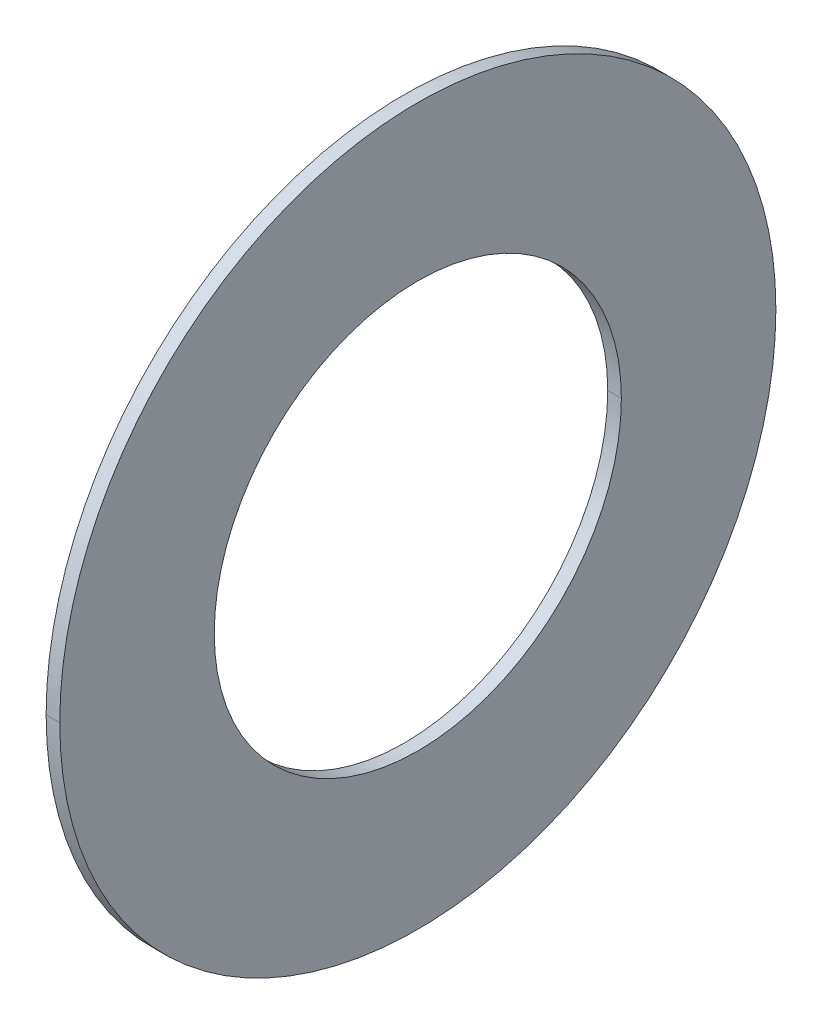
ISO-10303-21;
HEADER;
FILE_DESCRIPTION(('STEP AP214'),'2;1');
FILE_NAME('part.step','',(''),(''),'','','');
FILE_SCHEMA(('AUTOMOTIVE_DESIGN { 1 0 10303 214 1 1 1 1 }'));
ENDSEC;
DATA;
#1=APPLICATION_CONTEXT('core data for automotive mechanical design processes');
#2=APPLICATION_PROTOCOL_DEFINITION('international standard','automotive_design',2000,#1);
#3=PRODUCT_CONTEXT('',#1,'mechanical');
#4=PRODUCT('Part','Part','',(#3));
#5=PRODUCT_RELATED_PRODUCT_CATEGORY('part','',(#4));
#6=PRODUCT_DEFINITION_FORMATION('','',#4);
#7=PRODUCT_DEFINITION_CONTEXT('part definition',#1,'design');
#8=PRODUCT_DEFINITION('design','',#6,#7);
#9=PRODUCT_DEFINITION_SHAPE('','',#8);
#10=(LENGTH_UNIT() NAMED_UNIT(*) SI_UNIT(.MILLI.,.METRE.));
#11=(NAMED_UNIT(*) PLANE_ANGLE_UNIT() SI_UNIT($,.RADIAN.));
#12=(NAMED_UNIT(*) SI_UNIT($,.STERADIAN.) SOLID_ANGLE_UNIT());
#13=UNCERTAINTY_MEASURE_WITH_UNIT(LENGTH_MEASURE(1.E-05),#10,'distance_accuracy_value','');
#14=(GEOMETRIC_REPRESENTATION_CONTEXT(3) GLOBAL_UNCERTAINTY_ASSIGNED_CONTEXT((#13)) GLOBAL_UNIT_ASSIGNED_CONTEXT((#10,
#11,#12)) REPRESENTATION_CONTEXT('',''));
#15=CARTESIAN_POINT('',(0.,0.,0.));
#16=DIRECTION('',(0.,0.,1.));
#17=DIRECTION('',(1.,0.,0.));
#18=AXIS2_PLACEMENT_3D('',#15,#16,#17);
#19=CARTESIAN_POINT('',(0.25,4.925,0.));
#20=DIRECTION('',(-1.,0.,0.));
#21=DIRECTION('',(0.,0.,1.));
#22=AXIS2_PLACEMENT_3D('',#19,#20,#21);
#23=PLANE('',#22);
#24=CARTESIAN_POINT('',(0.25,0.,0.));
#25=DIRECTION('',(1.,0.,0.));
#26=DIRECTION('',(0.,0.,-1.));
#27=AXIS2_PLACEMENT_3D('',#24,#25,#26);
#28=CIRCLE('',#27,2.8);
#29=CARTESIAN_POINT('',(0.25,0.,-2.8));
#30=VERTEX_POINT('',#29);
#31=CARTESIAN_POINT('',(0.25,0.,2.8));
#32=VERTEX_POINT('',#31);
#33=EDGE_CURVE('E11',#30,#32,#28,.T.);
#34=ORIENTED_EDGE('',*,*,#33,.T.);
#35=CARTESIAN_POINT('',(0.25,0.,0.));
#36=DIRECTION('',(1.,0.,0.));
#37=DIRECTION('',(0.,0.,-1.));
#38=AXIS2_PLACEMENT_3D('',#35,#36,#37);
#39=CIRCLE('',#38,2.8);
#40=EDGE_CURVE('E25',#32,#30,#39,.T.);
#41=ORIENTED_EDGE('',*,*,#40,.T.);
#42=EDGE_LOOP('',(#34,#41));
#43=FACE_BOUND('',#42,.T.);
#44=CARTESIAN_POINT('',(0.25,0.,0.));
#45=DIRECTION('',(1.,0.,0.));
#46=DIRECTION('',(0.,0.,-1.));
#47=AXIS2_PLACEMENT_3D('',#44,#45,#46);
#48=CIRCLE('',#47,4.925);
#49=CARTESIAN_POINT('',(0.25,0.,-4.925));
#50=VERTEX_POINT('',#49);
#51=CARTESIAN_POINT('',(0.25,0.,4.925));
#52=VERTEX_POINT('',#51);
#53=EDGE_CURVE('E96',#50,#52,#48,.T.);
#54=ORIENTED_EDGE('',*,*,#53,.F.);
#55=CARTESIAN_POINT('',(0.25,0.,0.));
#56=DIRECTION('',(1.,0.,0.));
#57=DIRECTION('',(0.,0.,-1.));
#58=AXIS2_PLACEMENT_3D('',#55,#56,#57);
#59=CIRCLE('',#58,4.925);
#60=EDGE_CURVE('E91',#52,#50,#59,.T.);
#61=ORIENTED_EDGE('',*,*,#60,.F.);
#62=EDGE_LOOP('',(#54,#61));
#63=FACE_BOUND('',#62,.T.);
#64=ADVANCED_FACE('F17',(#43,#63),#23,.T.);
#65=CARTESIAN_POINT('',(0.4374,0.,0.));
#66=DIRECTION('',(-1.,0.,0.));
#67=DIRECTION('',(0.,1.,0.));
#68=AXIS2_PLACEMENT_3D('',#65,#66,#67);
#69=CYLINDRICAL_SURFACE('',#68,4.925);
#70=ORIENTED_EDGE('',*,*,#60,.T.);
#71=DIRECTION('',(-1.,0.,0.));
#72=VECTOR('',#71,1.);
#73=CARTESIAN_POINT('',(0.4374,0.,-4.925));
#74=LINE('',#73,#72);
#75=CARTESIAN_POINT('',(0.4374,0.,-4.925));
#76=VERTEX_POINT('',#75);
#77=EDGE_CURVE('E86',#76,#50,#74,.T.);
#78=ORIENTED_EDGE('',*,*,#77,.F.);
#79=CARTESIAN_POINT('',(0.4374,0.,0.));
#80=DIRECTION('',(1.,0.,0.));
#81=DIRECTION('',(0.,0.,-1.));
#82=AXIS2_PLACEMENT_3D('',#79,#80,#81);
#83=CIRCLE('',#82,4.925);
#84=CARTESIAN_POINT('',(0.4374,0.,4.925));
#85=VERTEX_POINT('',#84);
#86=EDGE_CURVE('E81',#85,#76,#83,.T.);
#87=ORIENTED_EDGE('',*,*,#86,.F.);
#88=DIRECTION('',(-1.,0.,0.));
#89=VECTOR('',#88,1.);
#90=CARTESIAN_POINT('',(0.4374,0.,4.925));
#91=LINE('',#90,#89);
#92=EDGE_CURVE('E70',#85,#52,#91,.T.);
#93=ORIENTED_EDGE('',*,*,#92,.T.);
#94=EDGE_LOOP('',(#70,#78,#87,#93));
#95=FACE_BOUND('',#94,.T.);
#96=ADVANCED_FACE('F111',(#95),#69,.T.);
#97=CARTESIAN_POINT('',(0.4374,0.,0.));
#98=DIRECTION('',(-1.,0.,0.));
#99=DIRECTION('',(0.,-1.,0.));
#100=AXIS2_PLACEMENT_3D('',#97,#98,#99);
#101=CYLINDRICAL_SURFACE('',#100,4.925);
#102=CARTESIAN_POINT('',(0.4374,0.,0.));
#103=DIRECTION('',(1.,0.,0.));
#104=DIRECTION('',(0.,0.,-1.));
#105=AXIS2_PLACEMENT_3D('',#102,#103,#104);
#106=CIRCLE('',#105,4.925);
#107=EDGE_CURVE('E67',#76,#85,#106,.T.);
#108=ORIENTED_EDGE('',*,*,#107,.F.);
#109=ORIENTED_EDGE('',*,*,#77,.T.);
#110=ORIENTED_EDGE('',*,*,#53,.T.);
#111=ORIENTED_EDGE('',*,*,#92,.F.);
#112=EDGE_LOOP('',(#108,#109,#110,#111));
#113=FACE_BOUND('',#112,.T.);
#114=ADVANCED_FACE('F108',(#113),#101,.T.);
#115=CARTESIAN_POINT('',(0.4374,2.8,0.));
#116=DIRECTION('',(1.,0.,0.));
#117=DIRECTION('',(0.,0.,-1.));
#118=AXIS2_PLACEMENT_3D('',#115,#116,#117);
#119=PLANE('',#118);
#120=ORIENTED_EDGE('',*,*,#107,.T.);
#121=ORIENTED_EDGE('',*,*,#86,.T.);
#122=EDGE_LOOP('',(#120,#121));
#123=FACE_BOUND('',#122,.T.);
#124=CARTESIAN_POINT('',(0.4374,0.,0.));
#125=DIRECTION('',(1.,0.,0.));
#126=DIRECTION('',(0.,0.,-1.));
#127=AXIS2_PLACEMENT_3D('',#124,#125,#126);
#128=CIRCLE('',#127,2.8);
#129=CARTESIAN_POINT('',(0.4374,0.,-2.8));
#130=VERTEX_POINT('',#129);
#131=CARTESIAN_POINT('',(0.4374,0.,2.8));
#132=VERTEX_POINT('',#131);
#133=EDGE_CURVE('E56',#130,#132,#128,.T.);
#134=ORIENTED_EDGE('',*,*,#133,.F.);
#135=CARTESIAN_POINT('',(0.4374,0.,0.));
#136=DIRECTION('',(1.,0.,0.));
#137=DIRECTION('',(0.,0.,-1.));
#138=AXIS2_PLACEMENT_3D('',#135,#136,#137);
#139=CIRCLE('',#138,2.8);
#140=EDGE_CURVE('E52',#132,#130,#139,.T.);
#141=ORIENTED_EDGE('',*,*,#140,.F.);
#142=EDGE_LOOP('',(#134,#141));
#143=FACE_BOUND('',#142,.T.);
#144=ADVANCED_FACE('F54',(#123,#143),#119,.T.);
#145=CARTESIAN_POINT('',(0.4374,0.,0.));
#146=DIRECTION('',(-1.,0.,0.));
#147=DIRECTION('',(0.,1.,0.));
#148=AXIS2_PLACEMENT_3D('',#145,#146,#147);
#149=CYLINDRICAL_SURFACE('',#148,2.8);
#150=ORIENTED_EDGE('',*,*,#40,.F.);
#151=DIRECTION('',(-1.,0.,0.));
#152=VECTOR('',#151,1.);
#153=CARTESIAN_POINT('',(0.4374,0.,2.8));
#154=LINE('',#153,#152);
#155=EDGE_CURVE('E59',#132,#32,#154,.T.);
#156=ORIENTED_EDGE('',*,*,#155,.F.);
#157=ORIENTED_EDGE('',*,*,#140,.T.);
#158=DIRECTION('',(-1.,0.,0.));
#159=VECTOR('',#158,1.);
#160=CARTESIAN_POINT('',(0.4374,0.,-2.8));
#161=LINE('',#160,#159);
#162=EDGE_CURVE('E64',#130,#30,#161,.T.);
#163=ORIENTED_EDGE('',*,*,#162,.T.);
#164=EDGE_LOOP('',(#150,#156,#157,#163));
#165=FACE_BOUND('',#164,.T.);
#166=ADVANCED_FACE('F62',(#165),#149,.F.);
#167=CARTESIAN_POINT('',(0.4374,0.,0.));
#168=DIRECTION('',(-1.,0.,0.));
#169=DIRECTION('',(0.,-1.,0.));
#170=AXIS2_PLACEMENT_3D('',#167,#168,#169);
#171=CYLINDRICAL_SURFACE('',#170,2.8);
#172=ORIENTED_EDGE('',*,*,#133,.T.);
#173=ORIENTED_EDGE('',*,*,#155,.T.);
#174=ORIENTED_EDGE('',*,*,#33,.F.);
#175=ORIENTED_EDGE('',*,*,#162,.F.);
#176=EDGE_LOOP('',(#172,#173,#174,#175));
#177=FACE_BOUND('',#176,.T.);
#178=ADVANCED_FACE('F66',(#177),#171,.F.);
#179=CLOSED_SHELL('',(#64,#96,#114,#144,#166,#178));
#180=MANIFOLD_SOLID_BREP('B1',#179);
#181=ADVANCED_BREP_SHAPE_REPRESENTATION('',(#18,#180),#14);
#182=SHAPE_DEFINITION_REPRESENTATION(#9,#181);
ENDSEC;
END-ISO-10303-21;
